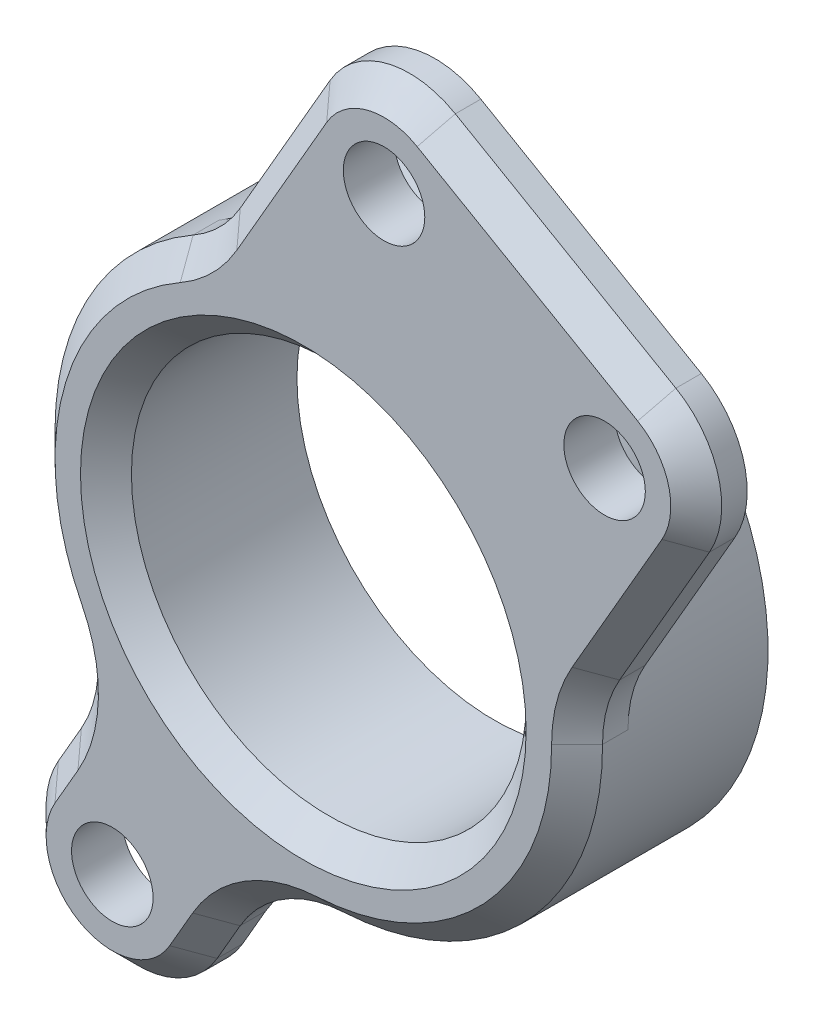
ISO-10303-21;
HEADER;
FILE_DESCRIPTION(('STEP AP214'),'2;1');
FILE_NAME('part.step','',(''),(''),'','','');
FILE_SCHEMA(('AUTOMOTIVE_DESIGN { 1 0 10303 214 1 1 1 1 }'));
ENDSEC;
DATA;
#1=APPLICATION_CONTEXT('core data for automotive mechanical design processes');
#2=APPLICATION_PROTOCOL_DEFINITION('international standard','automotive_design',2000,#1);
#3=PRODUCT_CONTEXT('',#1,'mechanical');
#4=PRODUCT('Part','Part','',(#3));
#5=PRODUCT_RELATED_PRODUCT_CATEGORY('part','',(#4));
#6=PRODUCT_DEFINITION_FORMATION('','',#4);
#7=PRODUCT_DEFINITION_CONTEXT('part definition',#1,'design');
#8=PRODUCT_DEFINITION('design','',#6,#7);
#9=PRODUCT_DEFINITION_SHAPE('','',#8);
#10=(LENGTH_UNIT() NAMED_UNIT(*) SI_UNIT(.MILLI.,.METRE.));
#11=(NAMED_UNIT(*) PLANE_ANGLE_UNIT() SI_UNIT($,.RADIAN.));
#12=(NAMED_UNIT(*) SI_UNIT($,.STERADIAN.) SOLID_ANGLE_UNIT());
#13=UNCERTAINTY_MEASURE_WITH_UNIT(LENGTH_MEASURE(1.E-05),#10,'distance_accuracy_value','');
#14=(GEOMETRIC_REPRESENTATION_CONTEXT(3) GLOBAL_UNCERTAINTY_ASSIGNED_CONTEXT((#13)) GLOBAL_UNIT_ASSIGNED_CONTEXT((#10,
#11,#12)) REPRESENTATION_CONTEXT('',''));
#15=CARTESIAN_POINT('',(0.,0.,0.));
#16=DIRECTION('',(0.,0.,1.));
#17=DIRECTION('',(1.,0.,0.));
#18=AXIS2_PLACEMENT_3D('',#15,#16,#17);
#19=CARTESIAN_POINT('',(0.,0.,0.));
#20=DIRECTION('',(0.,0.,1.));
#21=DIRECTION('',(1.,0.,0.));
#22=AXIS2_PLACEMENT_3D('',#19,#20,#21);
#23=PLANE('',#22);
#24=CARTESIAN_POINT('',(3.16987298107781,15.4903810567665,0.));
#25=DIRECTION('',(0.,0.,1.));
#26=DIRECTION('',(1.,0.,0.));
#27=AXIS2_PLACEMENT_3D('',#24,#25,#26);
#28=CIRCLE('',#27,1.6);
#29=CARTESIAN_POINT('',(4.76987298107781,15.4903810567665,0.));
#30=VERTEX_POINT('',#29);
#31=EDGE_CURVE('E257',#30,#30,#28,.T.);
#32=ORIENTED_EDGE('',*,*,#31,.T.);
#33=EDGE_LOOP('',(#32));
#34=FACE_BOUND('',#33,.T.);
#35=CARTESIAN_POINT('',(11.8301270189222,10.4903810567665,0.));
#36=DIRECTION('',(0.,0.,1.));
#37=DIRECTION('',(1.,0.,0.));
#38=AXIS2_PLACEMENT_3D('',#35,#36,#37);
#39=CIRCLE('',#38,1.6);
#40=CARTESIAN_POINT('',(13.4301270189222,10.4903810567665,0.));
#41=VERTEX_POINT('',#40);
#42=EDGE_CURVE('E253',#41,#41,#39,.T.);
#43=ORIENTED_EDGE('',*,*,#42,.T.);
#44=EDGE_LOOP('',(#43));
#45=FACE_BOUND('',#44,.T.);
#46=DIRECTION('',(-0.500000000000001,-0.866025403784438,0.));
#47=VECTOR('',#46,1.);
#48=CARTESIAN_POINT('',(7.44781847254616,-4.3,0.));
#49=LINE('',#48,#47);
#50=CARTESIAN_POINT('',(14.9478184725461,8.69038105676655,0.));
#51=VERTEX_POINT('',#50);
#52=CARTESIAN_POINT('',(11.4196725735927,2.57945310326333,0.));
#53=VERTEX_POINT('',#52);
#54=EDGE_CURVE('E233',#51,#53,#49,.T.);
#55=ORIENTED_EDGE('',*,*,#54,.T.);
#56=CARTESIAN_POINT('',(15.7497995925148,0.0794531032633251,0.));
#57=DIRECTION('',(0.,0.,1.));
#58=DIRECTION('',(1.,0.,0.));
#59=AXIS2_PLACEMENT_3D('',#56,#57,#58);
#60=CIRCLE('',#59,5.);
#61=CARTESIAN_POINT('',(10.7498632139387,0.0542298958781293,0.));
#62=VERTEX_POINT('',#61);
#63=EDGE_CURVE('E313',#53,#62,#60,.T.);
#64=ORIENTED_EDGE('',*,*,#63,.T.);
#65=CARTESIAN_POINT('',(0.,0.,0.));
#66=DIRECTION('',(0.,0.,1.));
#67=DIRECTION('',(1.,0.,0.));
#68=AXIS2_PLACEMENT_3D('',#65,#66,#67);
#69=CIRCLE('',#68,10.75);
#70=CARTESIAN_POINT('',(-5.3279671394943,9.33676957841782,0.));
#71=VERTEX_POINT('',#70);
#72=EDGE_CURVE('E464',#62,#71,#69,.T.);
#73=ORIENTED_EDGE('',*,*,#72,.T.);
#74=CARTESIAN_POINT('',(-7.80609139042187,13.6794531032633,0.));
#75=DIRECTION('',(0.,0.,1.));
#76=DIRECTION('',(1.,0.,0.));
#77=AXIS2_PLACEMENT_3D('',#74,#75,#76);
#78=CIRCLE('',#77,5.);
#79=CARTESIAN_POINT('',(-3.47596437149967,11.1794531032633,0.));
#80=VERTEX_POINT('',#79);
#81=EDGE_CURVE('E304',#71,#80,#78,.T.);
#82=ORIENTED_EDGE('',*,*,#81,.T.);
#83=DIRECTION('',(-0.500000000000001,-0.866025403784438,0.));
#84=VECTOR('',#83,1.);
#85=CARTESIAN_POINT('',(-7.44781847254617,4.3,0.));
#86=LINE('',#85,#84);
#87=CARTESIAN_POINT('',(0.0521815274538246,17.2903810567665,0.));
#88=VERTEX_POINT('',#87);
#89=EDGE_CURVE('E249',#88,#80,#86,.T.);
#90=ORIENTED_EDGE('',*,*,#89,.F.);
#91=CARTESIAN_POINT('',(3.16987298107781,15.4903810567665,0.));
#92=DIRECTION('',(0.,0.,1.));
#93=DIRECTION('',(1.,0.,0.));
#94=AXIS2_PLACEMENT_3D('',#91,#92,#93);
#95=CIRCLE('',#94,3.6);
#96=CARTESIAN_POINT('',(4.96987298107781,18.6080725103905,0.));
#97=VERTEX_POINT('',#96);
#98=EDGE_CURVE('E245',#97,#88,#95,.T.);
#99=ORIENTED_EDGE('',*,*,#98,.F.);
#100=DIRECTION('',(0.866025403784438,-0.500000000000001,0.));
#101=VECTOR('',#100,1.);
#102=CARTESIAN_POINT('',(9.29999999999999,16.1080725103905,0.));
#103=LINE('',#102,#101);
#104=CARTESIAN_POINT('',(13.6301270189222,13.6080725103905,0.));
#105=VERTEX_POINT('',#104);
#106=EDGE_CURVE('E241',#97,#105,#103,.T.);
#107=ORIENTED_EDGE('',*,*,#106,.T.);
#108=CARTESIAN_POINT('',(11.8301270189222,10.4903810567665,0.));
#109=DIRECTION('',(0.,0.,1.));
#110=DIRECTION('',(1.,0.,0.));
#111=AXIS2_PLACEMENT_3D('',#108,#109,#110);
#112=CIRCLE('',#111,3.6);
#113=EDGE_CURVE('E237',#105,#51,#112,.F.);
#114=ORIENTED_EDGE('',*,*,#113,.T.);
#115=EDGE_LOOP('',(#55,#64,#73,#82,#90,#99,#107,#114));
#116=FACE_BOUND('',#115,.T.);
#117=ADVANCED_FACE('F48',(#34,#45,#116),#23,.F.);
#118=CARTESIAN_POINT('',(-3.11769145362399,1.80000000000001,2.));
#119=DIRECTION('',(-0.866025403784439,0.5,0.));
#120=DIRECTION('',(-0.5,-0.866025403784439,0.));
#121=AXIS2_PLACEMENT_3D('',#118,#119,#120);
#122=PLANE('',#121);
#123=DIRECTION('',(0.,0.,-1.));
#124=VECTOR('',#123,1.);
#125=CARTESIAN_POINT('',(-10.617691453624,-11.1903810567666,2.));
#126=LINE('',#125,#124);
#127=CARTESIAN_POINT('',(-10.617691453624,-11.1903810567666,0.999999999999991));
#128=VERTEX_POINT('',#127);
#129=CARTESIAN_POINT('',(-10.617691453624,-11.1903810567666,0.));
#130=VERTEX_POINT('',#129);
#131=EDGE_CURVE('E195',#128,#130,#126,.T.);
#132=ORIENTED_EDGE('',*,*,#131,.F.);
#133=DIRECTION('',(0.5,0.866025403784439,0.));
#134=VECTOR('',#133,1.);
#135=CARTESIAN_POINT('',(-3.11769145362399,1.80000000000001,0.999999999999991));
#136=LINE('',#135,#134);
#137=CARTESIAN_POINT('',(-9.71508677299059,-9.62702389076004,0.999999999999992));
#138=VERTEX_POINT('',#137);
#139=EDGE_CURVE('E370',#128,#138,#136,.T.);
#140=ORIENTED_EDGE('',*,*,#139,.T.);
#141=DIRECTION('',(0.,0.,-1.));
#142=VECTOR('',#141,1.);
#143=CARTESIAN_POINT('',(-9.71508677299059,-9.62702389076004,2.));
#144=LINE('',#143,#142);
#145=CARTESIAN_POINT('',(-9.71508677299059,-9.62702389076004,0.));
#146=VERTEX_POINT('',#145);
#147=EDGE_CURVE('E220',#138,#146,#144,.T.);
#148=ORIENTED_EDGE('',*,*,#147,.T.);
#149=DIRECTION('',(0.5,0.866025403784439,0.));
#150=VECTOR('',#149,1.);
#151=CARTESIAN_POINT('',(-3.11769145362399,1.80000000000001,0.));
#152=LINE('',#151,#150);
#153=EDGE_CURVE('E213',#130,#146,#152,.T.);
#154=ORIENTED_EDGE('',*,*,#153,.F.);
#155=EDGE_LOOP('',(#132,#140,#148,#154));
#156=FACE_BOUND('',#155,.T.);
#157=ADVANCED_FACE('F218',(#156),#122,.T.);
#158=CARTESIAN_POINT('',(-7.50000000000003,-12.9903810567666,2.));
#159=DIRECTION('',(0.,0.,-1.));
#160=DIRECTION('',(-1.,0.,0.));
#161=AXIS2_PLACEMENT_3D('',#158,#159,#160);
#162=CYLINDRICAL_SURFACE('',#161,3.6);
#163=DIRECTION('',(0.,0.,-1.));
#164=VECTOR('',#163,1.);
#165=CARTESIAN_POINT('',(-4.38230854637605,-14.7903810567666,2.));
#166=LINE('',#165,#164);
#167=CARTESIAN_POINT('',(-4.38230854637605,-14.7903810567666,0.999999999999992));
#168=VERTEX_POINT('',#167);
#169=CARTESIAN_POINT('',(-4.38230854637605,-14.7903810567666,0.));
#170=VERTEX_POINT('',#169);
#171=EDGE_CURVE('E206',#168,#170,#166,.T.);
#172=ORIENTED_EDGE('',*,*,#171,.F.);
#173=CARTESIAN_POINT('',(-7.50000000000003,-12.9903810567666,0.999999999999992));
#174=DIRECTION('',(0.,0.,1.));
#175=DIRECTION('',(1.,0.,0.));
#176=AXIS2_PLACEMENT_3D('',#173,#174,#175);
#177=CIRCLE('',#176,3.6);
#178=EDGE_CURVE('E201',#168,#128,#177,.F.);
#179=ORIENTED_EDGE('',*,*,#178,.T.);
#180=ORIENTED_EDGE('',*,*,#131,.T.);
#181=CARTESIAN_POINT('',(-7.50000000000003,-12.9903810567666,0.));
#182=DIRECTION('',(0.,0.,1.));
#183=DIRECTION('',(1.,0.,0.));
#184=AXIS2_PLACEMENT_3D('',#181,#182,#183);
#185=CIRCLE('',#184,3.6);
#186=EDGE_CURVE('E199',#130,#170,#185,.T.);
#187=ORIENTED_EDGE('',*,*,#186,.T.);
#188=EDGE_LOOP('',(#172,#179,#180,#187));
#189=FACE_BOUND('',#188,.T.);
#190=ADVANCED_FACE('F198',(#189),#162,.T.);
#191=CARTESIAN_POINT('',(3.11769145362398,-1.8,2.));
#192=DIRECTION('',(-0.866025403784438,0.5,0.));
#193=DIRECTION('',(-0.5,-0.866025403784438,0.));
#194=AXIS2_PLACEMENT_3D('',#191,#192,#193);
#195=PLANE('',#194);
#196=DIRECTION('',(0.,0.,1.));
#197=VECTOR('',#196,1.);
#198=CARTESIAN_POINT('',(-3.47970386574262,-13.22702389076,2.));
#199=LINE('',#198,#197);
#200=CARTESIAN_POINT('',(-3.47970386574262,-13.22702389076,0.));
#201=VERTEX_POINT('',#200);
#202=CARTESIAN_POINT('',(-3.47970386574262,-13.22702389076,0.999999999999992));
#203=VERTEX_POINT('',#202);
#204=EDGE_CURVE('E297',#201,#203,#199,.T.);
#205=ORIENTED_EDGE('',*,*,#204,.T.);
#206=DIRECTION('',(-0.5,-0.866025403784438,0.));
#207=VECTOR('',#206,1.);
#208=CARTESIAN_POINT('',(-4.38230854637605,-14.7903810567666,0.999999999999992));
#209=LINE('',#208,#207);
#210=EDGE_CURVE('E373',#203,#168,#209,.T.);
#211=ORIENTED_EDGE('',*,*,#210,.T.);
#212=ORIENTED_EDGE('',*,*,#171,.T.);
#213=DIRECTION('',(0.5,0.866025403784438,0.));
#214=VECTOR('',#213,1.);
#215=CARTESIAN_POINT('',(3.11769145362398,-1.8,0.));
#216=LINE('',#215,#214);
#217=EDGE_CURVE('E215',#170,#201,#216,.T.);
#218=ORIENTED_EDGE('',*,*,#217,.T.);
#219=EDGE_LOOP('',(#205,#211,#212,#218));
#220=FACE_BOUND('',#219,.T.);
#221=ADVANCED_FACE('F538',(#220),#195,.F.);
#222=CARTESIAN_POINT('',(7.44781847254616,-4.3,2.));
#223=DIRECTION('',(0.866025403784438,-0.500000000000001,0.));
#224=DIRECTION('',(0.500000000000001,0.866025403784438,0.));
#225=AXIS2_PLACEMENT_3D('',#222,#223,#224);
#226=PLANE('',#225);
#227=DIRECTION('',(0.,0.,-1.));
#228=VECTOR('',#227,1.);
#229=CARTESIAN_POINT('',(14.9478184725461,8.69038105676655,2.));
#230=LINE('',#229,#228);
#231=CARTESIAN_POINT('',(14.9478184725461,8.69038105676655,0.999999999999992));
#232=VERTEX_POINT('',#231);
#233=EDGE_CURVE('E272',#232,#51,#230,.T.);
#234=ORIENTED_EDGE('',*,*,#233,.F.);
#235=DIRECTION('',(-0.500000000000001,-0.866025403784438,0.));
#236=VECTOR('',#235,1.);
#237=CARTESIAN_POINT('',(7.44781847254616,-4.3,0.999999999999991));
#238=LINE('',#237,#236);
#239=CARTESIAN_POINT('',(11.4196725735927,2.57945310326333,0.999999999999991));
#240=VERTEX_POINT('',#239);
#241=EDGE_CURVE('E397',#232,#240,#238,.T.);
#242=ORIENTED_EDGE('',*,*,#241,.T.);
#243=DIRECTION('',(0.,0.,-1.));
#244=VECTOR('',#243,1.);
#245=CARTESIAN_POINT('',(11.4196725735927,2.57945310326333,2.));
#246=LINE('',#245,#244);
#247=EDGE_CURVE('E301',#240,#53,#246,.T.);
#248=ORIENTED_EDGE('',*,*,#247,.T.);
#249=ORIENTED_EDGE('',*,*,#54,.F.);
#250=EDGE_LOOP('',(#234,#242,#248,#249));
#251=FACE_BOUND('',#250,.T.);
#252=ADVANCED_FACE('F534',(#251),#226,.T.);
#253=CARTESIAN_POINT('',(11.8301270189222,10.4903810567665,2.));
#254=DIRECTION('',(0.,0.,-1.));
#255=DIRECTION('',(-1.,0.,0.));
#256=AXIS2_PLACEMENT_3D('',#253,#254,#255);
#257=CYLINDRICAL_SURFACE('',#256,3.6);
#258=DIRECTION('',(0.,0.,-1.));
#259=VECTOR('',#258,1.);
#260=CARTESIAN_POINT('',(13.6301270189222,13.6080725103905,2.));
#261=LINE('',#260,#259);
#262=CARTESIAN_POINT('',(13.6301270189222,13.6080725103905,0.999999999999992));
#263=VERTEX_POINT('',#262);
#264=EDGE_CURVE('E269',#263,#105,#261,.T.);
#265=ORIENTED_EDGE('',*,*,#264,.F.);
#266=CARTESIAN_POINT('',(11.8301270189222,10.4903810567665,0.999999999999992));
#267=DIRECTION('',(0.,0.,1.));
#268=DIRECTION('',(1.,0.,0.));
#269=AXIS2_PLACEMENT_3D('',#266,#267,#268);
#270=CIRCLE('',#269,3.6);
#271=EDGE_CURVE('E59',#263,#232,#270,.F.);
#272=ORIENTED_EDGE('',*,*,#271,.T.);
#273=ORIENTED_EDGE('',*,*,#233,.T.);
#274=ORIENTED_EDGE('',*,*,#113,.F.);
#275=EDGE_LOOP('',(#265,#272,#273,#274));
#276=FACE_BOUND('',#275,.T.);
#277=ADVANCED_FACE('F531',(#276),#257,.T.);
#278=CARTESIAN_POINT('',(9.29999999999999,16.1080725103905,2.));
#279=DIRECTION('',(0.500000000000001,0.866025403784438,0.));
#280=DIRECTION('',(-0.866025403784438,0.500000000000001,0.));
#281=AXIS2_PLACEMENT_3D('',#278,#279,#280);
#282=PLANE('',#281);
#283=DIRECTION('',(0.,0.,-1.));
#284=VECTOR('',#283,1.);
#285=CARTESIAN_POINT('',(4.96987298107781,18.6080725103905,2.));
#286=LINE('',#285,#284);
#287=CARTESIAN_POINT('',(4.96987298107781,18.6080725103905,0.999999999999992));
#288=VERTEX_POINT('',#287);
#289=EDGE_CURVE('E265',#288,#97,#286,.T.);
#290=ORIENTED_EDGE('',*,*,#289,.F.);
#291=DIRECTION('',(0.866025403784438,-0.500000000000001,0.));
#292=VECTOR('',#291,1.);
#293=CARTESIAN_POINT('',(9.29999999999999,16.1080725103905,0.999999999999992));
#294=LINE('',#293,#292);
#295=EDGE_CURVE('E12',#288,#263,#294,.T.);
#296=ORIENTED_EDGE('',*,*,#295,.T.);
#297=ORIENTED_EDGE('',*,*,#264,.T.);
#298=ORIENTED_EDGE('',*,*,#106,.F.);
#299=EDGE_LOOP('',(#290,#296,#297,#298));
#300=FACE_BOUND('',#299,.T.);
#301=ADVANCED_FACE('F528',(#300),#282,.T.);
#302=CARTESIAN_POINT('',(3.16987298107781,15.4903810567665,2.));
#303=DIRECTION('',(0.,0.,-1.));
#304=DIRECTION('',(-1.,0.,0.));
#305=AXIS2_PLACEMENT_3D('',#302,#303,#304);
#306=CYLINDRICAL_SURFACE('',#305,3.6);
#307=DIRECTION('',(0.,0.,-1.));
#308=VECTOR('',#307,1.);
#309=CARTESIAN_POINT('',(0.0521815274538246,17.2903810567665,2.));
#310=LINE('',#309,#308);
#311=CARTESIAN_POINT('',(0.0521815274538246,17.2903810567665,0.999999999999992));
#312=VERTEX_POINT('',#311);
#313=EDGE_CURVE('E262',#312,#88,#310,.T.);
#314=ORIENTED_EDGE('',*,*,#313,.F.);
#315=CARTESIAN_POINT('',(3.16987298107781,15.4903810567665,0.999999999999992));
#316=DIRECTION('',(0.,0.,1.));
#317=DIRECTION('',(1.,0.,0.));
#318=AXIS2_PLACEMENT_3D('',#315,#316,#317);
#319=CIRCLE('',#318,3.6);
#320=EDGE_CURVE('E73',#312,#288,#319,.F.);
#321=ORIENTED_EDGE('',*,*,#320,.T.);
#322=ORIENTED_EDGE('',*,*,#289,.T.);
#323=ORIENTED_EDGE('',*,*,#98,.T.);
#324=EDGE_LOOP('',(#314,#321,#322,#323));
#325=FACE_BOUND('',#324,.T.);
#326=ADVANCED_FACE('F524',(#325),#306,.T.);
#327=CARTESIAN_POINT('',(-7.44781847254617,4.3,2.));
#328=DIRECTION('',(0.866025403784438,-0.500000000000001,0.));
#329=DIRECTION('',(0.500000000000001,0.866025403784438,0.));
#330=AXIS2_PLACEMENT_3D('',#327,#328,#329);
#331=PLANE('',#330);
#332=DIRECTION('',(0.,0.,1.));
#333=VECTOR('',#332,1.);
#334=CARTESIAN_POINT('',(-3.47596437149967,11.1794531032633,2.));
#335=LINE('',#334,#333);
#336=CARTESIAN_POINT('',(-3.47596437149967,11.1794531032633,0.999999999999994));
#337=VERTEX_POINT('',#336);
#338=EDGE_CURVE('E291',#80,#337,#335,.T.);
#339=ORIENTED_EDGE('',*,*,#338,.T.);
#340=DIRECTION('',(0.500000000000001,0.866025403784438,0.));
#341=VECTOR('',#340,1.);
#342=CARTESIAN_POINT('',(0.0521815274538241,17.2903810567665,0.999999999999994));
#343=LINE('',#342,#341);
#344=EDGE_CURVE('E394',#337,#312,#343,.T.);
#345=ORIENTED_EDGE('',*,*,#344,.T.);
#346=ORIENTED_EDGE('',*,*,#313,.T.);
#347=ORIENTED_EDGE('',*,*,#89,.T.);
#348=EDGE_LOOP('',(#339,#345,#346,#347));
#349=FACE_BOUND('',#348,.T.);
#350=ADVANCED_FACE('F513',(#349),#331,.F.);
#351=CARTESIAN_POINT('',(11.8301270189222,10.4903810567665,2.));
#352=DIRECTION('',(0.,0.,-1.));
#353=DIRECTION('',(-1.,0.,0.));
#354=AXIS2_PLACEMENT_3D('',#351,#352,#353);
#355=CYLINDRICAL_SURFACE('',#354,1.6);
#356=CARTESIAN_POINT('',(11.8301270189222,10.4903810567665,2.));
#357=DIRECTION('',(0.,0.,1.));
#358=DIRECTION('',(1.,0.,0.));
#359=AXIS2_PLACEMENT_3D('',#356,#357,#358);
#360=CIRCLE('',#359,1.6);
#361=CARTESIAN_POINT('',(13.4301270189222,10.4903810567665,2.));
#362=VERTEX_POINT('',#361);
#363=EDGE_CURVE('E476',#362,#362,#360,.T.);
#364=ORIENTED_EDGE('',*,*,#363,.T.);
#365=EDGE_LOOP('',(#364));
#366=FACE_BOUND('',#365,.T.);
#367=ORIENTED_EDGE('',*,*,#42,.F.);
#368=EDGE_LOOP('',(#367));
#369=FACE_BOUND('',#368,.T.);
#370=ADVANCED_FACE('F509',(#366,#369),#355,.F.);
#371=CARTESIAN_POINT('',(0.,0.,2.));
#372=DIRECTION('',(0.,0.,-1.));
#373=DIRECTION('',(-1.,0.,0.));
#374=AXIS2_PLACEMENT_3D('',#371,#372,#373);
#375=CYLINDRICAL_SURFACE('',#374,7.75);
#376=CARTESIAN_POINT('',(0.,0.,0.999999999999988));
#377=DIRECTION('',(0.,0.,1.));
#378=DIRECTION('',(1.,0.,0.));
#379=AXIS2_PLACEMENT_3D('',#376,#377,#378);
#380=CIRCLE('',#379,7.75);
#381=CARTESIAN_POINT('',(7.74999999999997,0.,0.999999999999988));
#382=VERTEX_POINT('',#381);
#383=EDGE_CURVE('E317',#382,#382,#380,.T.);
#384=ORIENTED_EDGE('',*,*,#383,.T.);
#385=EDGE_LOOP('',(#384));
#386=FACE_BOUND('',#385,.T.);
#387=CARTESIAN_POINT('',(0.,0.,-5.50000000000001));
#388=DIRECTION('',(0.,0.,-1.));
#389=DIRECTION('',(-1.,0.,0.));
#390=AXIS2_PLACEMENT_3D('',#387,#388,#389);
#391=CIRCLE('',#390,7.75);
#392=CARTESIAN_POINT('',(-7.75000000000002,0.,-5.5));
#393=VERTEX_POINT('',#392);
#394=EDGE_CURVE('E227',#393,#393,#391,.F.);
#395=ORIENTED_EDGE('',*,*,#394,.F.);
#396=EDGE_LOOP('',(#395));
#397=FACE_BOUND('',#396,.T.);
#398=ADVANCED_FACE('F512',(#386,#397),#375,.F.);
#399=CARTESIAN_POINT('',(0.,0.,2.));
#400=DIRECTION('',(0.,0.,-1.));
#401=DIRECTION('',(-1.,0.,0.));
#402=AXIS2_PLACEMENT_3D('',#399,#400,#401);
#403=CYLINDRICAL_SURFACE('',#402,10.75);
#404=DIRECTION('',(0.,0.,-1.));
#405=VECTOR('',#404,1.);
#406=CARTESIAN_POINT('',(-9.58641576273413,-4.8644766238521,2.));
#407=LINE('',#406,#405);
#408=CARTESIAN_POINT('',(-9.58641576273413,-4.8644766238521,0.));
#409=VERTEX_POINT('',#408);
#410=CARTESIAN_POINT('',(-9.58641576273413,-4.8644766238521,0.999999999999992));
#411=VERTEX_POINT('',#410);
#412=EDGE_CURVE('E284',#409,#411,#407,.F.);
#413=ORIENTED_EDGE('',*,*,#412,.T.);
#414=CARTESIAN_POINT('',(0.,0.,0.999999999999992));
#415=DIRECTION('',(0.,0.,1.));
#416=DIRECTION('',(1.,0.,0.));
#417=AXIS2_PLACEMENT_3D('',#414,#415,#416);
#418=CIRCLE('',#417,10.75);
#419=CARTESIAN_POINT('',(-5.3279671394943,9.33676957841782,0.999999999999992));
#420=VERTEX_POINT('',#419);
#421=EDGE_CURVE('E385',#411,#420,#418,.F.);
#422=ORIENTED_EDGE('',*,*,#421,.T.);
#423=DIRECTION('',(0.,0.,-1.));
#424=VECTOR('',#423,1.);
#425=CARTESIAN_POINT('',(-5.3279671394943,9.33676957841782,2.));
#426=LINE('',#425,#424);
#427=EDGE_CURVE('E288',#420,#71,#426,.T.);
#428=ORIENTED_EDGE('',*,*,#427,.T.);
#429=ORIENTED_EDGE('',*,*,#72,.F.);
#430=DIRECTION('',(0.,0.,-1.));
#431=VECTOR('',#430,1.);
#432=CARTESIAN_POINT('',(10.7498632139387,0.0542298958781293,2.));
#433=LINE('',#432,#431);
#434=CARTESIAN_POINT('',(10.7498632139387,0.0542298958781293,0.999999999999992));
#435=VERTEX_POINT('',#434);
#436=EDGE_CURVE('E277',#62,#435,#433,.F.);
#437=ORIENTED_EDGE('',*,*,#436,.T.);
#438=CARTESIAN_POINT('',(0.,0.,0.999999999999992));
#439=DIRECTION('',(0.,0.,1.));
#440=DIRECTION('',(1.,0.,0.));
#441=AXIS2_PLACEMENT_3D('',#438,#439,#440);
#442=CIRCLE('',#441,10.75);
#443=CARTESIAN_POINT('',(0.580447548995569,-10.7343178936934,0.999999999999992));
#444=VERTEX_POINT('',#443);
#445=EDGE_CURVE('E382',#435,#444,#442,.F.);
#446=ORIENTED_EDGE('',*,*,#445,.T.);
#447=DIRECTION('',(0.,0.,-1.));
#448=VECTOR('',#447,1.);
#449=CARTESIAN_POINT('',(0.580447548995569,-10.7343178936934,2.));
#450=LINE('',#449,#448);
#451=CARTESIAN_POINT('',(0.580447548995569,-10.7343178936934,0.));
#452=VERTEX_POINT('',#451);
#453=EDGE_CURVE('E281',#444,#452,#450,.T.);
#454=ORIENTED_EDGE('',*,*,#453,.T.);
#455=EDGE_CURVE('E205',#409,#452,#69,.T.);
#456=ORIENTED_EDGE('',*,*,#455,.F.);
#457=EDGE_LOOP('',(#413,#422,#428,#429,#437,#446,#454,#456));
#458=FACE_BOUND('',#457,.T.);
#459=CARTESIAN_POINT('',(0.,0.,-5.50000000000001));
#460=DIRECTION('',(0.,0.,-1.));
#461=DIRECTION('',(-1.,0.,0.));
#462=AXIS2_PLACEMENT_3D('',#459,#460,#461);
#463=CIRCLE('',#462,10.75);
#464=CARTESIAN_POINT('',(-10.75,0.,-5.5));
#465=VERTEX_POINT('',#464);
#466=EDGE_CURVE('E458',#465,#465,#463,.F.);
#467=ORIENTED_EDGE('',*,*,#466,.T.);
#468=EDGE_LOOP('',(#467));
#469=FACE_BOUND('',#468,.T.);
#470=ADVANCED_FACE('F517',(#458,#469),#403,.T.);
#471=CARTESIAN_POINT('',(-7.50000000000003,-12.9903810567666,2.));
#472=DIRECTION('',(0.,0.,-1.));
#473=DIRECTION('',(-1.,0.,0.));
#474=AXIS2_PLACEMENT_3D('',#471,#472,#473);
#475=CYLINDRICAL_SURFACE('',#474,1.6);
#476=CARTESIAN_POINT('',(-7.50000000000003,-12.9903810567666,2.));
#477=DIRECTION('',(0.,0.,1.));
#478=DIRECTION('',(1.,0.,0.));
#479=AXIS2_PLACEMENT_3D('',#476,#477,#478);
#480=CIRCLE('',#479,1.6);
#481=CARTESIAN_POINT('',(-5.90000000000003,-12.9903810567666,2.));
#482=VERTEX_POINT('',#481);
#483=EDGE_CURVE('E261',#482,#482,#480,.T.);
#484=ORIENTED_EDGE('',*,*,#483,.T.);
#485=EDGE_LOOP('',(#484));
#486=FACE_BOUND('',#485,.T.);
#487=CARTESIAN_POINT('',(-7.50000000000003,-12.9903810567666,0.));
#488=DIRECTION('',(0.,0.,1.));
#489=DIRECTION('',(1.,0.,0.));
#490=AXIS2_PLACEMENT_3D('',#487,#488,#489);
#491=CIRCLE('',#490,1.6);
#492=CARTESIAN_POINT('',(-5.90000000000003,-12.9903810567666,0.));
#493=VERTEX_POINT('',#492);
#494=EDGE_CURVE('E223',#493,#493,#491,.T.);
#495=ORIENTED_EDGE('',*,*,#494,.F.);
#496=EDGE_LOOP('',(#495));
#497=FACE_BOUND('',#496,.T.);
#498=ADVANCED_FACE('F497',(#486,#497),#475,.F.);
#499=CARTESIAN_POINT('',(3.16987298107781,15.4903810567665,2.));
#500=DIRECTION('',(0.,0.,-1.));
#501=DIRECTION('',(-1.,0.,0.));
#502=AXIS2_PLACEMENT_3D('',#499,#500,#501);
#503=CYLINDRICAL_SURFACE('',#502,1.6);
#504=CARTESIAN_POINT('',(3.16987298107781,15.4903810567665,2.));
#505=DIRECTION('',(0.,0.,1.));
#506=DIRECTION('',(1.,0.,0.));
#507=AXIS2_PLACEMENT_3D('',#504,#505,#506);
#508=CIRCLE('',#507,1.6);
#509=CARTESIAN_POINT('',(4.76987298107781,15.4903810567665,2.));
#510=VERTEX_POINT('',#509);
#511=EDGE_CURVE('E266',#510,#510,#508,.T.);
#512=ORIENTED_EDGE('',*,*,#511,.T.);
#513=EDGE_LOOP('',(#512));
#514=FACE_BOUND('',#513,.T.);
#515=ORIENTED_EDGE('',*,*,#31,.F.);
#516=EDGE_LOOP('',(#515));
#517=FACE_BOUND('',#516,.T.);
#518=ADVANCED_FACE('F483',(#514,#517),#503,.F.);
#519=CARTESIAN_POINT('',(0.,0.,2.));
#520=DIRECTION('',(0.,0.,1.));
#521=DIRECTION('',(1.,0.,0.));
#522=AXIS2_PLACEMENT_3D('',#519,#520,#521);
#523=PLANE('',#522);
#524=CARTESIAN_POINT('',(0.,0.,2.));
#525=DIRECTION('',(0.,0.,1.));
#526=DIRECTION('',(1.,0.,0.));
#527=AXIS2_PLACEMENT_3D('',#524,#525,#526);
#528=CIRCLE('',#527,8.75000000000001);
#529=CARTESIAN_POINT('',(8.74999999999998,0.,2.));
#530=VERTEX_POINT('',#529);
#531=EDGE_CURVE('E364',#530,#530,#528,.F.);
#532=ORIENTED_EDGE('',*,*,#531,.T.);
#533=EDGE_LOOP('',(#532));
#534=FACE_BOUND('',#533,.T.);
#535=DIRECTION('',(-0.5,-0.866025403784439,0.));
#536=VECTOR('',#535,1.);
#537=CARTESIAN_POINT('',(-2.25166604983954,1.3,2.));
#538=LINE('',#537,#536);
#539=CARTESIAN_POINT('',(-8.84906136920614,-10.12702389076,2.));
#540=VERTEX_POINT('',#539);
#541=CARTESIAN_POINT('',(-9.75166604983957,-11.6903810567666,2.));
#542=VERTEX_POINT('',#541);
#543=EDGE_CURVE('E357',#540,#542,#538,.T.);
#544=ORIENTED_EDGE('',*,*,#543,.T.);
#545=CARTESIAN_POINT('',(-7.50000000000003,-12.9903810567666,2.));
#546=DIRECTION('',(0.,0.,1.));
#547=DIRECTION('',(1.,0.,0.));
#548=AXIS2_PLACEMENT_3D('',#545,#546,#547);
#549=CIRCLE('',#548,2.59999999999999);
#550=CARTESIAN_POINT('',(-5.2483339501605,-14.2903810567666,2.));
#551=VERTEX_POINT('',#550);
#552=EDGE_CURVE('E360',#542,#551,#549,.T.);
#553=ORIENTED_EDGE('',*,*,#552,.T.);
#554=DIRECTION('',(0.5,0.866025403784438,0.));
#555=VECTOR('',#554,1.);
#556=CARTESIAN_POINT('',(-4.34572926952707,-12.72702389076,2.));
#557=LINE('',#556,#555);
#558=CARTESIAN_POINT('',(-4.34572926952707,-12.72702389076,2.));
#559=VERTEX_POINT('',#558);
#560=EDGE_CURVE('E354',#551,#559,#557,.T.);
#561=ORIENTED_EDGE('',*,*,#560,.T.);
#562=CARTESIAN_POINT('',(0.850423153179568,-15.72702389076,2.));
#563=DIRECTION('',(0.,0.,1.));
#564=DIRECTION('',(1.,0.,0.));
#565=AXIS2_PLACEMENT_3D('',#562,#563,#564);
#566=CIRCLE('',#565,6.00000000000001);
#567=CARTESIAN_POINT('',(0.526452428158769,-9.73577669428003,2.));
#568=VERTEX_POINT('',#567);
#569=EDGE_CURVE('E348',#559,#568,#566,.F.);
#570=ORIENTED_EDGE('',*,*,#569,.T.);
#571=CARTESIAN_POINT('',(0.,0.,2.));
#572=DIRECTION('',(0.,0.,1.));
#573=DIRECTION('',(1.,0.,0.));
#574=AXIS2_PLACEMENT_3D('',#571,#572,#573);
#575=CIRCLE('',#574,9.74999999999998);
#576=CARTESIAN_POINT('',(9.74987593822345,0.0491852544010901,2.));
#577=VERTEX_POINT('',#576);
#578=EDGE_CURVE('E342',#568,#577,#575,.T.);
#579=ORIENTED_EDGE('',*,*,#578,.T.);
#580=CARTESIAN_POINT('',(15.7497995925148,0.0794531032633251,2.));
#581=DIRECTION('',(0.,0.,1.));
#582=DIRECTION('',(1.,0.,0.));
#583=AXIS2_PLACEMENT_3D('',#580,#581,#582);
#584=CIRCLE('',#583,6.00000000000001);
#585=CARTESIAN_POINT('',(10.5536471698082,3.07945310326334,2.));
#586=VERTEX_POINT('',#585);
#587=EDGE_CURVE('E336',#577,#586,#584,.F.);
#588=ORIENTED_EDGE('',*,*,#587,.T.);
#589=DIRECTION('',(0.500000000000001,0.866025403784438,0.));
#590=VECTOR('',#589,1.);
#591=CARTESIAN_POINT('',(6.58179306876171,-3.79999999999999,2.));
#592=LINE('',#591,#590);
#593=CARTESIAN_POINT('',(14.0817930687617,9.19038105676655,2.));
#594=VERTEX_POINT('',#593);
#595=EDGE_CURVE('E330',#586,#594,#592,.T.);
#596=ORIENTED_EDGE('',*,*,#595,.T.);
#597=CARTESIAN_POINT('',(11.8301270189222,10.4903810567665,2.));
#598=DIRECTION('',(0.,0.,1.));
#599=DIRECTION('',(1.,0.,0.));
#600=AXIS2_PLACEMENT_3D('',#597,#598,#599);
#601=CIRCLE('',#600,2.59999999999999);
#602=CARTESIAN_POINT('',(13.1301270189222,12.7420471066061,2.));
#603=VERTEX_POINT('',#602);
#604=EDGE_CURVE('E324',#594,#603,#601,.T.);
#605=ORIENTED_EDGE('',*,*,#604,.T.);
#606=DIRECTION('',(-0.866025403784438,0.5,0.));
#607=VECTOR('',#606,1.);
#608=CARTESIAN_POINT('',(8.79999999999999,15.2420471066061,2.));
#609=LINE('',#608,#607);
#610=CARTESIAN_POINT('',(4.46987298107781,17.7420471066061,2.));
#611=VERTEX_POINT('',#610);
#612=EDGE_CURVE('E321',#603,#611,#609,.T.);
#613=ORIENTED_EDGE('',*,*,#612,.T.);
#614=CARTESIAN_POINT('',(3.16987298107781,15.4903810567665,2.));
#615=DIRECTION('',(0.,0.,1.));
#616=DIRECTION('',(1.,0.,0.));
#617=AXIS2_PLACEMENT_3D('',#614,#615,#616);
#618=CIRCLE('',#617,2.59999999999999);
#619=CARTESIAN_POINT('',(0.918206931238274,16.7903810567665,2.));
#620=VERTEX_POINT('',#619);
#621=EDGE_CURVE('E327',#611,#620,#618,.T.);
#622=ORIENTED_EDGE('',*,*,#621,.T.);
#623=DIRECTION('',(-0.500000000000001,-0.866025403784438,0.));
#624=VECTOR('',#623,1.);
#625=CARTESIAN_POINT('',(-2.60993896771522,10.6794531032633,2.));
#626=LINE('',#625,#624);
#627=CARTESIAN_POINT('',(-2.60993896771522,10.6794531032633,2.));
#628=VERTEX_POINT('',#627);
#629=EDGE_CURVE('E333',#620,#628,#626,.T.);
#630=ORIENTED_EDGE('',*,*,#629,.T.);
#631=CARTESIAN_POINT('',(-7.80609139042187,13.6794531032633,2.));
#632=DIRECTION('',(0.,0.,1.));
#633=DIRECTION('',(1.,0.,0.));
#634=AXIS2_PLACEMENT_3D('',#631,#632,#633);
#635=CIRCLE('',#634,6.00000000000001);
#636=CARTESIAN_POINT('',(-4.83234228930878,8.4682328734487,2.));
#637=VERTEX_POINT('',#636);
#638=EDGE_CURVE('E339',#628,#637,#635,.F.);
#639=ORIENTED_EDGE('',*,*,#638,.T.);
#640=CARTESIAN_POINT('',(0.,0.,2.));
#641=DIRECTION('',(0.,0.,1.));
#642=DIRECTION('',(1.,0.,0.));
#643=AXIS2_PLACEMENT_3D('',#640,#641,#642);
#644=CIRCLE('',#643,9.74999999999998);
#645=CARTESIAN_POINT('',(-8.69465615689839,-4.41196717047051,2.));
#646=VERTEX_POINT('',#645);
#647=EDGE_CURVE('E345',#637,#646,#644,.T.);
#648=ORIENTED_EDGE('',*,*,#647,.T.);
#649=CARTESIAN_POINT('',(-14.0452137919128,-7.12702389076004,2.));
#650=DIRECTION('',(0.,0.,1.));
#651=DIRECTION('',(1.,0.,0.));
#652=AXIS2_PLACEMENT_3D('',#649,#650,#651);
#653=CIRCLE('',#652,6.00000000000001);
#654=EDGE_CURVE('E351',#646,#540,#653,.F.);
#655=ORIENTED_EDGE('',*,*,#654,.T.);
#656=EDGE_LOOP('',(#544,#553,#561,#570,#579,#588,#596,#605,#613,#622,#630,#639,#648,#655));
#657=FACE_BOUND('',#656,.T.);
#658=ORIENTED_EDGE('',*,*,#483,.F.);
#659=EDGE_LOOP('',(#658));
#660=FACE_BOUND('',#659,.T.);
#661=ORIENTED_EDGE('',*,*,#363,.F.);
#662=EDGE_LOOP('',(#661));
#663=FACE_BOUND('',#662,.T.);
#664=ORIENTED_EDGE('',*,*,#511,.F.);
#665=EDGE_LOOP('',(#664));
#666=FACE_BOUND('',#665,.T.);
#667=ADVANCED_FACE('F486',(#534,#657,#660,#663,#666),#523,.T.);
#668=ORIENTED_EDGE('',*,*,#494,.T.);
#669=EDGE_LOOP('',(#668));
#670=FACE_BOUND('',#669,.T.);
#671=ORIENTED_EDGE('',*,*,#153,.T.);
#672=CARTESIAN_POINT('',(-14.0452137919128,-7.12702389076004,0.));
#673=DIRECTION('',(0.,0.,1.));
#674=DIRECTION('',(1.,0.,0.));
#675=AXIS2_PLACEMENT_3D('',#672,#673,#674);
#676=CIRCLE('',#675,5.);
#677=EDGE_CURVE('E307',#146,#409,#676,.T.);
#678=ORIENTED_EDGE('',*,*,#677,.T.);
#679=ORIENTED_EDGE('',*,*,#455,.T.);
#680=CARTESIAN_POINT('',(0.850423153179568,-15.72702389076,0.));
#681=DIRECTION('',(0.,0.,1.));
#682=DIRECTION('',(1.,0.,0.));
#683=AXIS2_PLACEMENT_3D('',#680,#681,#682);
#684=CIRCLE('',#683,5.);
#685=EDGE_CURVE('E310',#452,#201,#684,.T.);
#686=ORIENTED_EDGE('',*,*,#685,.T.);
#687=ORIENTED_EDGE('',*,*,#217,.F.);
#688=ORIENTED_EDGE('',*,*,#186,.F.);
#689=EDGE_LOOP('',(#671,#678,#679,#686,#687,#688));
#690=FACE_BOUND('',#689,.T.);
#691=ADVANCED_FACE('F211',(#670,#690),#23,.F.);
#692=CARTESIAN_POINT('',(0.,0.,-5.50000000000001));
#693=DIRECTION('',(0.,0.,-1.));
#694=DIRECTION('',(-0.882224510299151,0.470828964091444,0.));
#695=AXIS2_PLACEMENT_3D('',#692,#693,#694);
#696=PLANE('',#695);
#697=ORIENTED_EDGE('',*,*,#466,.F.);
#698=EDGE_LOOP('',(#697));
#699=FACE_BOUND('',#698,.T.);
#700=ORIENTED_EDGE('',*,*,#394,.T.);
#701=EDGE_LOOP('',(#700));
#702=FACE_BOUND('',#701,.T.);
#703=ADVANCED_FACE('F494',(#699,#702),#696,.T.);
#704=CARTESIAN_POINT('',(-7.80609139042187,13.6794531032633,2.));
#705=DIRECTION('',(0.,0.,-1.));
#706=DIRECTION('',(-1.,0.,0.));
#707=AXIS2_PLACEMENT_3D('',#704,#705,#706);
#708=CYLINDRICAL_SURFACE('',#707,5.);
#709=ORIENTED_EDGE('',*,*,#427,.F.);
#710=CARTESIAN_POINT('',(-7.80609139042187,13.6794531032633,0.999999999999992));
#711=DIRECTION('',(0.,0.,1.));
#712=DIRECTION('',(1.,0.,0.));
#713=AXIS2_PLACEMENT_3D('',#710,#711,#712);
#714=CIRCLE('',#713,5.);
#715=EDGE_CURVE('E388',#420,#337,#714,.T.);
#716=ORIENTED_EDGE('',*,*,#715,.T.);
#717=ORIENTED_EDGE('',*,*,#338,.F.);
#718=ORIENTED_EDGE('',*,*,#81,.F.);
#719=EDGE_LOOP('',(#709,#716,#717,#718));
#720=FACE_BOUND('',#719,.T.);
#721=ADVANCED_FACE('F548',(#720),#708,.F.);
#722=CARTESIAN_POINT('',(-14.0452137919128,-7.12702389076004,2.));
#723=DIRECTION('',(0.,0.,-1.));
#724=DIRECTION('',(-1.,0.,0.));
#725=AXIS2_PLACEMENT_3D('',#722,#723,#724);
#726=CYLINDRICAL_SURFACE('',#725,5.);
#727=ORIENTED_EDGE('',*,*,#147,.F.);
#728=CARTESIAN_POINT('',(-14.0452137919128,-7.12702389076004,0.999999999999992));
#729=DIRECTION('',(0.,0.,1.));
#730=DIRECTION('',(1.,0.,0.));
#731=AXIS2_PLACEMENT_3D('',#728,#729,#730);
#732=CIRCLE('',#731,5.);
#733=EDGE_CURVE('E376',#138,#411,#732,.T.);
#734=ORIENTED_EDGE('',*,*,#733,.T.);
#735=ORIENTED_EDGE('',*,*,#412,.F.);
#736=ORIENTED_EDGE('',*,*,#677,.F.);
#737=EDGE_LOOP('',(#727,#734,#735,#736));
#738=FACE_BOUND('',#737,.T.);
#739=ADVANCED_FACE('F551',(#738),#726,.F.);
#740=CARTESIAN_POINT('',(0.850423153179568,-15.72702389076,2.));
#741=DIRECTION('',(0.,0.,-1.));
#742=DIRECTION('',(-1.,0.,0.));
#743=AXIS2_PLACEMENT_3D('',#740,#741,#742);
#744=CYLINDRICAL_SURFACE('',#743,5.);
#745=ORIENTED_EDGE('',*,*,#453,.F.);
#746=CARTESIAN_POINT('',(0.850423153179568,-15.72702389076,0.999999999999992));
#747=DIRECTION('',(0.,0.,1.));
#748=DIRECTION('',(1.,0.,0.));
#749=AXIS2_PLACEMENT_3D('',#746,#747,#748);
#750=CIRCLE('',#749,5.);
#751=EDGE_CURVE('E379',#444,#203,#750,.T.);
#752=ORIENTED_EDGE('',*,*,#751,.T.);
#753=ORIENTED_EDGE('',*,*,#204,.F.);
#754=ORIENTED_EDGE('',*,*,#685,.F.);
#755=EDGE_LOOP('',(#745,#752,#753,#754));
#756=FACE_BOUND('',#755,.T.);
#757=ADVANCED_FACE('F555',(#756),#744,.F.);
#758=CARTESIAN_POINT('',(15.7497995925148,0.0794531032633251,2.));
#759=DIRECTION('',(0.,0.,-1.));
#760=DIRECTION('',(-1.,0.,0.));
#761=AXIS2_PLACEMENT_3D('',#758,#759,#760);
#762=CYLINDRICAL_SURFACE('',#761,5.);
#763=ORIENTED_EDGE('',*,*,#247,.F.);
#764=CARTESIAN_POINT('',(15.7497995925148,0.0794531032633251,0.999999999999992));
#765=DIRECTION('',(0.,0.,1.));
#766=DIRECTION('',(1.,0.,0.));
#767=AXIS2_PLACEMENT_3D('',#764,#765,#766);
#768=CIRCLE('',#767,5.);
#769=EDGE_CURVE('E391',#240,#435,#768,.T.);
#770=ORIENTED_EDGE('',*,*,#769,.T.);
#771=ORIENTED_EDGE('',*,*,#436,.F.);
#772=ORIENTED_EDGE('',*,*,#63,.F.);
#773=EDGE_LOOP('',(#763,#770,#771,#772));
#774=FACE_BOUND('',#773,.T.);
#775=ADVANCED_FACE('F559',(#774),#762,.F.);
#776=CARTESIAN_POINT('',(0.,0.,0.999999999999988));
#777=DIRECTION('',(0.,0.,1.));
#778=DIRECTION('',(1.,0.,0.));
#779=AXIS2_PLACEMENT_3D('',#776,#777,#778);
#780=CONICAL_SURFACE('',#779,7.75,0.785398163397448);
#781=ORIENTED_EDGE('',*,*,#531,.F.);
#782=EDGE_LOOP('',(#781));
#783=FACE_BOUND('',#782,.T.);
#784=ORIENTED_EDGE('',*,*,#383,.F.);
#785=EDGE_LOOP('',(#784));
#786=FACE_BOUND('',#785,.T.);
#787=ADVANCED_FACE('F563',(#783,#786),#780,.F.);
#788=CARTESIAN_POINT('',(9.29999999999999,16.1080725103905,0.999999999999992));
#789=DIRECTION('',(-0.353553390593274,-0.612372435695794,-0.707106781186548));
#790=DIRECTION('',(0.866025403784438,-0.500000000000001,0.));
#791=AXIS2_PLACEMENT_3D('',#788,#789,#790);
#792=PLANE('',#791);
#793=DIRECTION('',(-0.353553390593274,-0.612372435695794,0.707106781186548));
#794=VECTOR('',#793,1.);
#795=CARTESIAN_POINT('',(13.6301270189222,13.6080725103905,0.999999999999992));
#796=LINE('',#795,#794);
#797=EDGE_CURVE('E449',#263,#603,#796,.T.);
#798=ORIENTED_EDGE('',*,*,#797,.F.);
#799=ORIENTED_EDGE('',*,*,#295,.F.);
#800=DIRECTION('',(0.353553390593274,0.612372435695795,-0.707106781186547));
#801=VECTOR('',#800,1.);
#802=CARTESIAN_POINT('',(4.46987298107781,17.7420471066061,2.));
#803=LINE('',#802,#801);
#804=EDGE_CURVE('E53',#611,#288,#803,.T.);
#805=ORIENTED_EDGE('',*,*,#804,.F.);
#806=ORIENTED_EDGE('',*,*,#612,.F.);
#807=EDGE_LOOP('',(#798,#799,#805,#806));
#808=FACE_BOUND('',#807,.T.);
#809=ADVANCED_FACE('F51',(#808),#792,.F.);
#810=CARTESIAN_POINT('',(3.16987298107781,15.4903810567665,2.));
#811=DIRECTION('',(0.,0.,-1.));
#812=DIRECTION('',(-1.,0.,0.));
#813=AXIS2_PLACEMENT_3D('',#810,#811,#812);
#814=CONICAL_SURFACE('',#813,2.59999999999999,0.785398163397451);
#815=ORIENTED_EDGE('',*,*,#804,.T.);
#816=ORIENTED_EDGE('',*,*,#320,.F.);
#817=DIRECTION('',(-0.612372435695796,0.353553390593275,-0.707106781186546));
#818=VECTOR('',#817,1.);
#819=CARTESIAN_POINT('',(0.918206931238274,16.7903810567665,2.));
#820=LINE('',#819,#818);
#821=EDGE_CURVE('E446',#620,#312,#820,.T.);
#822=ORIENTED_EDGE('',*,*,#821,.F.);
#823=ORIENTED_EDGE('',*,*,#621,.F.);
#824=EDGE_LOOP('',(#815,#816,#822,#823));
#825=FACE_BOUND('',#824,.T.);
#826=ADVANCED_FACE('F654',(#825),#814,.T.);
#827=CARTESIAN_POINT('',(11.8301270189222,10.4903810567665,0.999999999999992));
#828=DIRECTION('',(0.,0.,-1.));
#829=DIRECTION('',(-1.,0.,0.));
#830=AXIS2_PLACEMENT_3D('',#827,#828,#829);
#831=CONICAL_SURFACE('',#830,3.6,0.785398163397451);
#832=ORIENTED_EDGE('',*,*,#797,.T.);
#833=ORIENTED_EDGE('',*,*,#604,.F.);
#834=DIRECTION('',(-0.612372435695796,0.353553390593274,0.707106781186546));
#835=VECTOR('',#834,1.);
#836=CARTESIAN_POINT('',(14.9478184725461,8.69038105676655,0.999999999999992));
#837=LINE('',#836,#835);
#838=EDGE_CURVE('E442',#232,#594,#837,.T.);
#839=ORIENTED_EDGE('',*,*,#838,.F.);
#840=ORIENTED_EDGE('',*,*,#271,.F.);
#841=EDGE_LOOP('',(#832,#833,#839,#840));
#842=FACE_BOUND('',#841,.T.);
#843=ADVANCED_FACE('F648',(#842),#831,.T.);
#844=CARTESIAN_POINT('',(-6.58179306876172,3.8,2.));
#845=DIRECTION('',(-0.612372435695793,0.353553390593273,0.707106781186549));
#846=DIRECTION('',(0.500000000000001,0.866025403784438,0.));
#847=AXIS2_PLACEMENT_3D('',#844,#845,#846);
#848=PLANE('',#847);
#849=ORIENTED_EDGE('',*,*,#821,.T.);
#850=ORIENTED_EDGE('',*,*,#344,.F.);
#851=DIRECTION('',(-0.612372435695797,0.353553390593276,-0.707106781186545));
#852=VECTOR('',#851,1.);
#853=CARTESIAN_POINT('',(-2.60993896771522,10.6794531032633,2.));
#854=LINE('',#853,#852);
#855=EDGE_CURVE('E438',#628,#337,#854,.T.);
#856=ORIENTED_EDGE('',*,*,#855,.F.);
#857=ORIENTED_EDGE('',*,*,#629,.F.);
#858=EDGE_LOOP('',(#849,#850,#856,#857));
#859=FACE_BOUND('',#858,.T.);
#860=ADVANCED_FACE('F641',(#859),#848,.T.);
#861=CARTESIAN_POINT('',(7.44781847254616,-4.3,0.999999999999992));
#862=DIRECTION('',(-0.612372435695793,0.353553390593273,-0.707106781186549));
#863=DIRECTION('',(-0.500000000000001,-0.866025403784438,0.));
#864=AXIS2_PLACEMENT_3D('',#861,#862,#863);
#865=PLANE('',#864);
#866=ORIENTED_EDGE('',*,*,#838,.T.);
#867=ORIENTED_EDGE('',*,*,#595,.F.);
#868=DIRECTION('',(-0.612372435695796,0.353553390593275,0.707106781186545));
#869=VECTOR('',#868,1.);
#870=CARTESIAN_POINT('',(11.4196725735927,2.57945310326333,0.999999999999991));
#871=LINE('',#870,#869);
#872=EDGE_CURVE('E434',#240,#586,#871,.T.);
#873=ORIENTED_EDGE('',*,*,#872,.F.);
#874=ORIENTED_EDGE('',*,*,#241,.F.);
#875=EDGE_LOOP('',(#866,#867,#873,#874));
#876=FACE_BOUND('',#875,.T.);
#877=ADVANCED_FACE('F634',(#876),#865,.F.);
#878=CARTESIAN_POINT('',(-7.80609139042187,13.6794531032633,2.));
#879=DIRECTION('',(0.,0.,1.));
#880=DIRECTION('',(1.,0.,0.));
#881=AXIS2_PLACEMENT_3D('',#878,#879,#880);
#882=CONICAL_SURFACE('',#881,6.00000000000001,0.785398163397451);
#883=ORIENTED_EDGE('',*,*,#855,.T.);
#884=ORIENTED_EDGE('',*,*,#715,.F.);
#885=DIRECTION('',(-0.350459692490745,0.614148193793075,-0.707106781186545));
#886=VECTOR('',#885,1.);
#887=CARTESIAN_POINT('',(-4.83234228930878,8.4682328734487,2.));
#888=LINE('',#887,#886);
#889=EDGE_CURVE('E430',#637,#420,#888,.T.);
#890=ORIENTED_EDGE('',*,*,#889,.F.);
#891=ORIENTED_EDGE('',*,*,#638,.F.);
#892=EDGE_LOOP('',(#883,#884,#890,#891));
#893=FACE_BOUND('',#892,.T.);
#894=ADVANCED_FACE('F627',(#893),#882,.F.);
#895=CARTESIAN_POINT('',(15.7497995925148,0.0794531032633251,2.));
#896=DIRECTION('',(0.,0.,1.));
#897=DIRECTION('',(1.,0.,0.));
#898=AXIS2_PLACEMENT_3D('',#895,#896,#897);
#899=CONICAL_SURFACE('',#898,6.00000000000001,0.78539816339745);
#900=ORIENTED_EDGE('',*,*,#872,.T.);
#901=ORIENTED_EDGE('',*,*,#587,.F.);
#902=DIRECTION('',(-0.707097783758502,-0.00356710019706932,0.707106781186546));
#903=VECTOR('',#902,1.);
#904=CARTESIAN_POINT('',(10.7498632139387,0.0542298958781293,0.999999999999992));
#905=LINE('',#904,#903);
#906=EDGE_CURVE('E426',#435,#577,#905,.T.);
#907=ORIENTED_EDGE('',*,*,#906,.F.);
#908=ORIENTED_EDGE('',*,*,#769,.F.);
#909=EDGE_LOOP('',(#900,#901,#907,#908));
#910=FACE_BOUND('',#909,.T.);
#911=ADVANCED_FACE('F620',(#910),#899,.F.);
#912=CARTESIAN_POINT('',(0.,0.,2.));
#913=DIRECTION('',(0.,0.,-1.));
#914=DIRECTION('',(-1.,0.,0.));
#915=AXIS2_PLACEMENT_3D('',#912,#913,#914);
#916=CONICAL_SURFACE('',#915,9.74999999999998,0.785398163397451);
#917=ORIENTED_EDGE('',*,*,#889,.T.);
#918=ORIENTED_EDGE('',*,*,#421,.F.);
#919=DIRECTION('',(-0.630569264474689,-0.319972503037139,-0.707106781186546));
#920=VECTOR('',#919,1.);
#921=CARTESIAN_POINT('',(-8.69465615689839,-4.41196717047051,2.));
#922=LINE('',#921,#920);
#923=EDGE_CURVE('E422',#646,#411,#922,.T.);
#924=ORIENTED_EDGE('',*,*,#923,.F.);
#925=ORIENTED_EDGE('',*,*,#647,.F.);
#926=EDGE_LOOP('',(#917,#918,#924,#925));
#927=FACE_BOUND('',#926,.T.);
#928=ADVANCED_FACE('F613',(#927),#916,.T.);
#929=CARTESIAN_POINT('',(0.,0.,2.));
#930=DIRECTION('',(0.,0.,-1.));
#931=DIRECTION('',(-1.,0.,0.));
#932=AXIS2_PLACEMENT_3D('',#929,#930,#931);
#933=CONICAL_SURFACE('',#932,9.74999999999998,0.785398163397451);
#934=ORIENTED_EDGE('',*,*,#906,.T.);
#935=ORIENTED_EDGE('',*,*,#578,.F.);
#936=DIRECTION('',(-0.0381803160946882,0.706075253399319,0.707106781186545));
#937=VECTOR('',#936,1.);
#938=CARTESIAN_POINT('',(0.580447548995569,-10.7343178936934,0.999999999999992));
#939=LINE('',#938,#937);
#940=EDGE_CURVE('E418',#444,#568,#939,.T.);
#941=ORIENTED_EDGE('',*,*,#940,.F.);
#942=ORIENTED_EDGE('',*,*,#445,.F.);
#943=EDGE_LOOP('',(#934,#935,#941,#942));
#944=FACE_BOUND('',#943,.T.);
#945=ADVANCED_FACE('F606',(#944),#933,.T.);
#946=CARTESIAN_POINT('',(-14.0452137919128,-7.12702389076004,2.));
#947=DIRECTION('',(0.,0.,1.));
#948=DIRECTION('',(1.,0.,0.));
#949=AXIS2_PLACEMENT_3D('',#946,#947,#948);
#950=CONICAL_SURFACE('',#949,6.00000000000001,0.785398163397451);
#951=ORIENTED_EDGE('',*,*,#923,.T.);
#952=ORIENTED_EDGE('',*,*,#733,.F.);
#953=DIRECTION('',(-0.612372435695796,0.353553390593275,-0.707106781186546));
#954=VECTOR('',#953,1.);
#955=CARTESIAN_POINT('',(-8.84906136920614,-10.12702389076,2.));
#956=LINE('',#955,#954);
#957=EDGE_CURVE('E414',#540,#138,#956,.T.);
#958=ORIENTED_EDGE('',*,*,#957,.F.);
#959=ORIENTED_EDGE('',*,*,#654,.F.);
#960=EDGE_LOOP('',(#951,#952,#958,#959));
#961=FACE_BOUND('',#960,.T.);
#962=ADVANCED_FACE('F599',(#961),#950,.F.);
#963=CARTESIAN_POINT('',(0.850423153179568,-15.72702389076,2.));
#964=DIRECTION('',(0.,0.,1.));
#965=DIRECTION('',(1.,0.,0.));
#966=AXIS2_PLACEMENT_3D('',#963,#964,#965);
#967=CONICAL_SURFACE('',#966,6.00000000000001,0.785398163397451);
#968=ORIENTED_EDGE('',*,*,#940,.T.);
#969=ORIENTED_EDGE('',*,*,#569,.F.);
#970=DIRECTION('',(-0.612372435695796,0.353553390593275,0.707106781186545));
#971=VECTOR('',#970,1.);
#972=CARTESIAN_POINT('',(-3.47970386574262,-13.22702389076,0.999999999999992));
#973=LINE('',#972,#971);
#974=EDGE_CURVE('E410',#203,#559,#973,.T.);
#975=ORIENTED_EDGE('',*,*,#974,.F.);
#976=ORIENTED_EDGE('',*,*,#751,.F.);
#977=EDGE_LOOP('',(#968,#969,#975,#976));
#978=FACE_BOUND('',#977,.T.);
#979=ADVANCED_FACE('F592',(#978),#967,.F.);
#980=CARTESIAN_POINT('',(-3.11769145362399,1.80000000000001,0.999999999999992));
#981=DIRECTION('',(0.612372435695793,-0.353553390593273,-0.707106781186549));
#982=DIRECTION('',(0.5,0.866025403784439,0.));
#983=AXIS2_PLACEMENT_3D('',#980,#981,#982);
#984=PLANE('',#983);
#985=ORIENTED_EDGE('',*,*,#957,.T.);
#986=ORIENTED_EDGE('',*,*,#139,.F.);
#987=DIRECTION('',(-0.612372435695795,0.353553390593275,-0.707106781186547));
#988=VECTOR('',#987,1.);
#989=CARTESIAN_POINT('',(-9.75166604983957,-11.6903810567666,2.));
#990=LINE('',#989,#988);
#991=EDGE_CURVE('E407',#542,#128,#990,.T.);
#992=ORIENTED_EDGE('',*,*,#991,.F.);
#993=ORIENTED_EDGE('',*,*,#543,.F.);
#994=EDGE_LOOP('',(#985,#986,#992,#993));
#995=FACE_BOUND('',#994,.T.);
#996=ADVANCED_FACE('F585',(#995),#984,.F.);
#997=CARTESIAN_POINT('',(2.25166604983953,-1.3,2.));
#998=DIRECTION('',(0.612372435695793,-0.353553390593273,0.707106781186549));
#999=DIRECTION('',(-0.5,-0.866025403784438,0.));
#1000=AXIS2_PLACEMENT_3D('',#997,#998,#999);
#1001=PLANE('',#1000);
#1002=ORIENTED_EDGE('',*,*,#974,.T.);
#1003=ORIENTED_EDGE('',*,*,#560,.F.);
#1004=DIRECTION('',(-0.612372435695795,0.353553390593275,0.707106781186546));
#1005=VECTOR('',#1004,1.);
#1006=CARTESIAN_POINT('',(-4.38230854637605,-14.7903810567666,0.999999999999992));
#1007=LINE('',#1006,#1005);
#1008=EDGE_CURVE('E404',#168,#551,#1007,.T.);
#1009=ORIENTED_EDGE('',*,*,#1008,.F.);
#1010=ORIENTED_EDGE('',*,*,#210,.F.);
#1011=EDGE_LOOP('',(#1002,#1003,#1009,#1010));
#1012=FACE_BOUND('',#1011,.T.);
#1013=ADVANCED_FACE('F578',(#1012),#1001,.T.);
#1014=CARTESIAN_POINT('',(-7.50000000000003,-12.9903810567666,2.));
#1015=DIRECTION('',(0.,0.,-1.));
#1016=DIRECTION('',(-1.,0.,0.));
#1017=AXIS2_PLACEMENT_3D('',#1014,#1015,#1016);
#1018=CONICAL_SURFACE('',#1017,2.59999999999999,0.785398163397451);
#1019=ORIENTED_EDGE('',*,*,#991,.T.);
#1020=ORIENTED_EDGE('',*,*,#178,.F.);
#1021=ORIENTED_EDGE('',*,*,#1008,.T.);
#1022=ORIENTED_EDGE('',*,*,#552,.F.);
#1023=EDGE_LOOP('',(#1019,#1020,#1021,#1022));
#1024=FACE_BOUND('',#1023,.T.);
#1025=ADVANCED_FACE('F572',(#1024),#1018,.T.);
#1026=CLOSED_SHELL('',(#117,#157,#190,#221,#252,#277,#301,#326,#350,#370,#398,#470,#498,#518,
#667,#691,#703,#721,#739,#757,#775,#787,#809,#826,#843,#860,#877,#894,#911,#928,#945,#962,#979,
#996,#1013,#1025));
#1027=MANIFOLD_SOLID_BREP('B2',#1026);
#1028=ADVANCED_BREP_SHAPE_REPRESENTATION('',(#18,#1027),#14);
#1029=SHAPE_DEFINITION_REPRESENTATION(#9,#1028);
ENDSEC;
END-ISO-10303-21;
